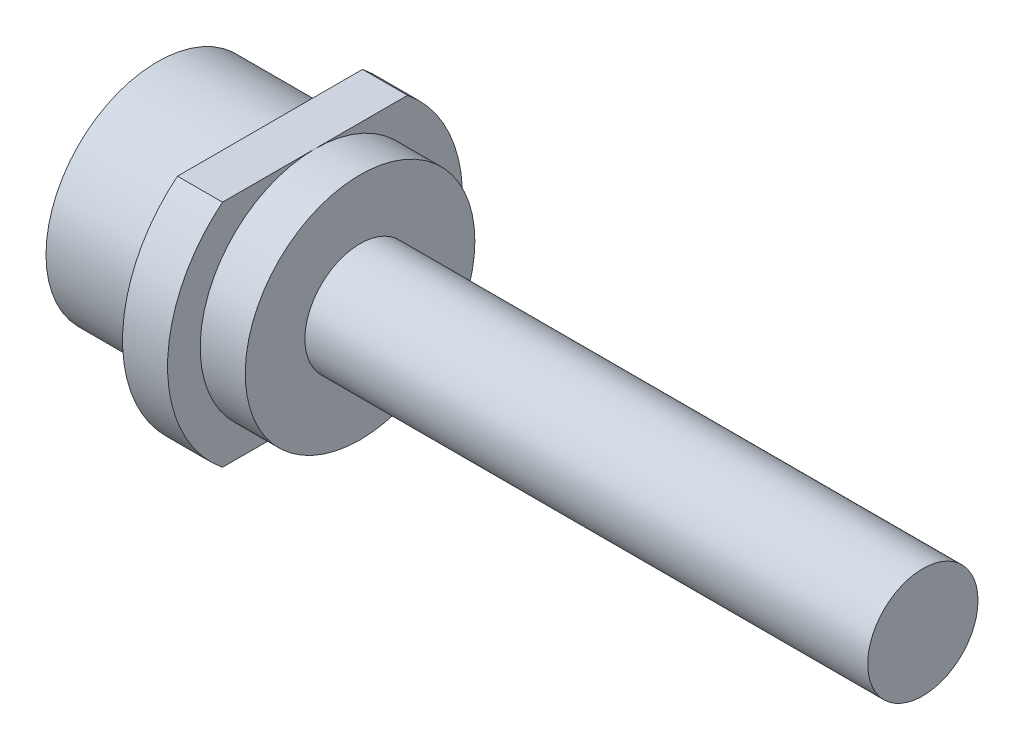
ISO-10303-21;
HEADER;
FILE_DESCRIPTION(('STEP AP214'),'2;1');
FILE_NAME('part.step','',(''),(''),'','','');
FILE_SCHEMA(('AUTOMOTIVE_DESIGN { 1 0 10303 214 1 1 1 1 }'));
ENDSEC;
DATA;
#1=APPLICATION_CONTEXT('core data for automotive mechanical design processes');
#2=APPLICATION_PROTOCOL_DEFINITION('international standard','automotive_design',2000,#1);
#3=PRODUCT_CONTEXT('',#1,'mechanical');
#4=PRODUCT('Part','Part','',(#3));
#5=PRODUCT_RELATED_PRODUCT_CATEGORY('part','',(#4));
#6=PRODUCT_DEFINITION_FORMATION('','',#4);
#7=PRODUCT_DEFINITION_CONTEXT('part definition',#1,'design');
#8=PRODUCT_DEFINITION('design','',#6,#7);
#9=PRODUCT_DEFINITION_SHAPE('','',#8);
#10=(LENGTH_UNIT() NAMED_UNIT(*) SI_UNIT(.MILLI.,.METRE.));
#11=(NAMED_UNIT(*) PLANE_ANGLE_UNIT() SI_UNIT($,.RADIAN.));
#12=(NAMED_UNIT(*) SI_UNIT($,.STERADIAN.) SOLID_ANGLE_UNIT());
#13=UNCERTAINTY_MEASURE_WITH_UNIT(LENGTH_MEASURE(1.E-05),#10,'distance_accuracy_value','');
#14=(GEOMETRIC_REPRESENTATION_CONTEXT(3) GLOBAL_UNCERTAINTY_ASSIGNED_CONTEXT((#13)) GLOBAL_UNIT_ASSIGNED_CONTEXT((#10,
#11,#12)) REPRESENTATION_CONTEXT('',''));
#15=CARTESIAN_POINT('',(0.,0.,0.));
#16=DIRECTION('',(0.,0.,1.));
#17=DIRECTION('',(1.,0.,0.));
#18=AXIS2_PLACEMENT_3D('',#15,#16,#17);
#19=CARTESIAN_POINT('',(2.,0.,0.));
#20=DIRECTION('',(1.,0.,0.));
#21=DIRECTION('',(0.,0.,-1.));
#22=AXIS2_PLACEMENT_3D('',#19,#20,#21);
#23=PLANE('',#22);
#24=CARTESIAN_POINT('',(2.,0.,0.));
#25=DIRECTION('',(1.,0.,0.));
#26=DIRECTION('',(0.,0.,-1.));
#27=AXIS2_PLACEMENT_3D('',#24,#25,#26);
#28=CIRCLE('',#27,5.1);
#29=CARTESIAN_POINT('',(2.,5.1,0.));
#30=VERTEX_POINT('',#29);
#31=CARTESIAN_POINT('',(2.,-5.1,0.));
#32=VERTEX_POINT('',#31);
#33=EDGE_CURVE('E112',#30,#32,#28,.T.);
#34=ORIENTED_EDGE('',*,*,#33,.F.);
#35=DIRECTION('',(0.,0.,1.));
#36=VECTOR('',#35,1.);
#37=CARTESIAN_POINT('',(2.,5.1,-4.11004866151242));
#38=LINE('',#37,#36);
#39=CARTESIAN_POINT('',(2.,5.1,4.11004866151242));
#40=VERTEX_POINT('',#39);
#41=EDGE_CURVE('E100',#30,#40,#38,.T.);
#42=ORIENTED_EDGE('',*,*,#41,.T.);
#43=CARTESIAN_POINT('',(2.,0.,0.));
#44=DIRECTION('',(1.,0.,0.));
#45=DIRECTION('',(0.,0.,-1.));
#46=AXIS2_PLACEMENT_3D('',#43,#44,#45);
#47=CIRCLE('',#46,6.55);
#48=CARTESIAN_POINT('',(2.,-5.1,4.11004866151242));
#49=VERTEX_POINT('',#48);
#50=EDGE_CURVE('E99',#40,#49,#47,.T.);
#51=ORIENTED_EDGE('',*,*,#50,.T.);
#52=DIRECTION('',(0.,0.,-1.));
#53=VECTOR('',#52,1.);
#54=CARTESIAN_POINT('',(2.,-5.1,-4.11004866151241));
#55=LINE('',#54,#53);
#56=EDGE_CURVE('E114',#49,#32,#55,.T.);
#57=ORIENTED_EDGE('',*,*,#56,.T.);
#58=EDGE_LOOP('',(#34,#42,#51,#57));
#59=FACE_BOUND('',#58,.T.);
#60=ADVANCED_FACE('F39',(#59),#23,.T.);
#61=CARTESIAN_POINT('',(2.,0.,0.));
#62=DIRECTION('',(-1.,0.,0.));
#63=DIRECTION('',(0.,0.,1.));
#64=AXIS2_PLACEMENT_3D('',#61,#62,#63);
#65=CYLINDRICAL_SURFACE('',#64,6.55);
#66=CARTESIAN_POINT('',(0.,0.,0.));
#67=DIRECTION('',(1.,0.,0.));
#68=DIRECTION('',(0.,0.,-1.));
#69=AXIS2_PLACEMENT_3D('',#66,#67,#68);
#70=CIRCLE('',#69,6.55);
#71=CARTESIAN_POINT('',(0.,-5.1,-4.11004866151241));
#72=VERTEX_POINT('',#71);
#73=CARTESIAN_POINT('',(0.,5.1,-4.11004866151242));
#74=VERTEX_POINT('',#73);
#75=EDGE_CURVE('E135',#72,#74,#70,.T.);
#76=ORIENTED_EDGE('',*,*,#75,.T.);
#77=DIRECTION('',(-1.,0.,0.));
#78=VECTOR('',#77,1.);
#79=CARTESIAN_POINT('',(2.,5.1,-4.11004866151242));
#80=LINE('',#79,#78);
#81=CARTESIAN_POINT('',(2.,5.1,-4.11004866151242));
#82=VERTEX_POINT('',#81);
#83=EDGE_CURVE('E43',#82,#74,#80,.T.);
#84=ORIENTED_EDGE('',*,*,#83,.F.);
#85=CARTESIAN_POINT('',(2.,0.,0.));
#86=DIRECTION('',(1.,0.,0.));
#87=DIRECTION('',(0.,0.,-1.));
#88=AXIS2_PLACEMENT_3D('',#85,#86,#87);
#89=CIRCLE('',#88,6.55);
#90=CARTESIAN_POINT('',(2.,-5.1,-4.11004866151241));
#91=VERTEX_POINT('',#90);
#92=EDGE_CURVE('E96',#91,#82,#89,.T.);
#93=ORIENTED_EDGE('',*,*,#92,.F.);
#94=DIRECTION('',(-1.,0.,0.));
#95=VECTOR('',#94,1.);
#96=CARTESIAN_POINT('',(2.,-5.1,-4.11004866151241));
#97=LINE('',#96,#95);
#98=EDGE_CURVE('E134',#91,#72,#97,.T.);
#99=ORIENTED_EDGE('',*,*,#98,.T.);
#100=EDGE_LOOP('',(#76,#84,#93,#99));
#101=FACE_BOUND('',#100,.T.);
#102=ADVANCED_FACE('F41',(#101),#65,.T.);
#103=CARTESIAN_POINT('',(2.,5.1,-4.11004866151242));
#104=DIRECTION('',(0.,-1.,0.));
#105=DIRECTION('',(0.,0.,-1.));
#106=AXIS2_PLACEMENT_3D('',#103,#104,#105);
#107=PLANE('',#106);
#108=DIRECTION('',(0.,0.,1.));
#109=VECTOR('',#108,1.);
#110=CARTESIAN_POINT('',(0.,5.1,-4.11004866151242));
#111=LINE('',#110,#109);
#112=CARTESIAN_POINT('',(0.,5.1,4.11004866151242));
#113=VERTEX_POINT('',#112);
#114=EDGE_CURVE('E139',#74,#113,#111,.T.);
#115=ORIENTED_EDGE('',*,*,#114,.T.);
#116=DIRECTION('',(-1.,0.,0.));
#117=VECTOR('',#116,1.);
#118=CARTESIAN_POINT('',(2.,5.1,4.11004866151242));
#119=LINE('',#118,#117);
#120=EDGE_CURVE('E106',#40,#113,#119,.T.);
#121=ORIENTED_EDGE('',*,*,#120,.F.);
#122=ORIENTED_EDGE('',*,*,#41,.F.);
#123=EDGE_CURVE('E91',#82,#30,#38,.T.);
#124=ORIENTED_EDGE('',*,*,#123,.F.);
#125=ORIENTED_EDGE('',*,*,#83,.T.);
#126=EDGE_LOOP('',(#115,#121,#122,#124,#125));
#127=FACE_BOUND('',#126,.T.);
#128=ADVANCED_FACE('F104',(#127),#107,.F.);
#129=CARTESIAN_POINT('',(2.,0.,0.));
#130=DIRECTION('',(-1.,0.,0.));
#131=DIRECTION('',(0.,0.,1.));
#132=AXIS2_PLACEMENT_3D('',#129,#130,#131);
#133=CYLINDRICAL_SURFACE('',#132,6.55);
#134=CARTESIAN_POINT('',(0.,0.,0.));
#135=DIRECTION('',(1.,0.,0.));
#136=DIRECTION('',(0.,0.,-1.));
#137=AXIS2_PLACEMENT_3D('',#134,#135,#136);
#138=CIRCLE('',#137,6.55);
#139=CARTESIAN_POINT('',(0.,-5.1,4.11004866151242));
#140=VERTEX_POINT('',#139);
#141=EDGE_CURVE('E142',#113,#140,#138,.T.);
#142=ORIENTED_EDGE('',*,*,#141,.T.);
#143=DIRECTION('',(-1.,0.,0.));
#144=VECTOR('',#143,1.);
#145=CARTESIAN_POINT('',(2.,-5.1,4.11004866151242));
#146=LINE('',#145,#144);
#147=EDGE_CURVE('E149',#49,#140,#146,.T.);
#148=ORIENTED_EDGE('',*,*,#147,.F.);
#149=ORIENTED_EDGE('',*,*,#50,.F.);
#150=ORIENTED_EDGE('',*,*,#120,.T.);
#151=EDGE_LOOP('',(#142,#148,#149,#150));
#152=FACE_BOUND('',#151,.T.);
#153=ADVANCED_FACE('F154',(#152),#133,.T.);
#154=CARTESIAN_POINT('',(2.,-5.1,-4.11004866151241));
#155=DIRECTION('',(0.,1.,0.));
#156=DIRECTION('',(0.,0.,1.));
#157=AXIS2_PLACEMENT_3D('',#154,#155,#156);
#158=PLANE('',#157);
#159=DIRECTION('',(0.,0.,-1.));
#160=VECTOR('',#159,1.);
#161=CARTESIAN_POINT('',(0.,-5.1,-4.11004866151241));
#162=LINE('',#161,#160);
#163=EDGE_CURVE('E84',#140,#72,#162,.T.);
#164=ORIENTED_EDGE('',*,*,#163,.T.);
#165=ORIENTED_EDGE('',*,*,#98,.F.);
#166=EDGE_CURVE('E62',#32,#91,#55,.T.);
#167=ORIENTED_EDGE('',*,*,#166,.F.);
#168=ORIENTED_EDGE('',*,*,#56,.F.);
#169=ORIENTED_EDGE('',*,*,#147,.T.);
#170=EDGE_LOOP('',(#164,#165,#167,#168,#169));
#171=FACE_BOUND('',#170,.T.);
#172=ADVANCED_FACE('F160',(#171),#158,.F.);
#173=EDGE_CURVE('E57',#32,#30,#28,.T.);
#174=ORIENTED_EDGE('',*,*,#173,.F.);
#175=ORIENTED_EDGE('',*,*,#166,.T.);
#176=ORIENTED_EDGE('',*,*,#92,.T.);
#177=ORIENTED_EDGE('',*,*,#123,.T.);
#178=EDGE_LOOP('',(#174,#175,#176,#177));
#179=FACE_BOUND('',#178,.T.);
#180=ADVANCED_FACE('F94',(#179),#23,.T.);
#181=CARTESIAN_POINT('',(0.,0.,0.));
#182=DIRECTION('',(1.,0.,0.));
#183=DIRECTION('',(0.,0.,-1.));
#184=AXIS2_PLACEMENT_3D('',#181,#182,#183);
#185=PLANE('',#184);
#186=CARTESIAN_POINT('',(0.,0.,0.));
#187=DIRECTION('',(-1.,0.,0.));
#188=DIRECTION('',(0.,0.,1.));
#189=AXIS2_PLACEMENT_3D('',#186,#187,#188);
#190=CIRCLE('',#189,4.95);
#191=CARTESIAN_POINT('',(0.,0.,4.95));
#192=VERTEX_POINT('',#191);
#193=EDGE_CURVE('E11',#192,#192,#190,.T.);
#194=ORIENTED_EDGE('',*,*,#193,.F.);
#195=EDGE_LOOP('',(#194));
#196=FACE_BOUND('',#195,.T.);
#197=ORIENTED_EDGE('',*,*,#75,.F.);
#198=ORIENTED_EDGE('',*,*,#163,.F.);
#199=ORIENTED_EDGE('',*,*,#141,.F.);
#200=ORIENTED_EDGE('',*,*,#114,.F.);
#201=EDGE_LOOP('',(#197,#198,#199,#200));
#202=FACE_BOUND('',#201,.T.);
#203=ADVANCED_FACE('F158',(#196,#202),#185,.F.);
#204=CARTESIAN_POINT('',(4.,0.,0.));
#205=DIRECTION('',(-1.,0.,0.));
#206=DIRECTION('',(0.,0.,1.));
#207=AXIS2_PLACEMENT_3D('',#204,#205,#206);
#208=CYLINDRICAL_SURFACE('',#207,5.1);
#209=CARTESIAN_POINT('',(4.,0.,0.));
#210=DIRECTION('',(1.,0.,0.));
#211=DIRECTION('',(0.,0.,-1.));
#212=AXIS2_PLACEMENT_3D('',#209,#210,#211);
#213=CIRCLE('',#212,5.1);
#214=CARTESIAN_POINT('',(4.,0.,-5.1));
#215=VERTEX_POINT('',#214);
#216=EDGE_CURVE('E117',#215,#215,#213,.T.);
#217=ORIENTED_EDGE('',*,*,#216,.F.);
#218=EDGE_LOOP('',(#217));
#219=FACE_BOUND('',#218,.T.);
#220=ORIENTED_EDGE('',*,*,#33,.T.);
#221=ORIENTED_EDGE('',*,*,#173,.T.);
#222=EDGE_LOOP('',(#220,#221));
#223=FACE_BOUND('',#222,.T.);
#224=ADVANCED_FACE('F120',(#219,#223),#208,.T.);
#225=CARTESIAN_POINT('',(4.,0.,0.));
#226=DIRECTION('',(1.,0.,0.));
#227=DIRECTION('',(0.,0.,-1.));
#228=AXIS2_PLACEMENT_3D('',#225,#226,#227);
#229=PLANE('',#228);
#230=CARTESIAN_POINT('',(4.,0.,0.));
#231=DIRECTION('',(1.,0.,0.));
#232=DIRECTION('',(0.,0.,-1.));
#233=AXIS2_PLACEMENT_3D('',#230,#231,#232);
#234=CIRCLE('',#233,2.45);
#235=CARTESIAN_POINT('',(4.,0.,-2.45));
#236=VERTEX_POINT('',#235);
#237=EDGE_CURVE('E49',#236,#236,#234,.T.);
#238=ORIENTED_EDGE('',*,*,#237,.F.);
#239=EDGE_LOOP('',(#238));
#240=FACE_BOUND('',#239,.T.);
#241=ORIENTED_EDGE('',*,*,#216,.T.);
#242=EDGE_LOOP('',(#241));
#243=FACE_BOUND('',#242,.T.);
#244=ADVANCED_FACE('F188',(#240,#243),#229,.T.);
#245=CARTESIAN_POINT('',(29.,0.,0.));
#246=DIRECTION('',(-1.,0.,0.));
#247=DIRECTION('',(0.,0.,1.));
#248=AXIS2_PLACEMENT_3D('',#245,#246,#247);
#249=CYLINDRICAL_SURFACE('',#248,2.45);
#250=CARTESIAN_POINT('',(29.,0.,0.));
#251=DIRECTION('',(1.,0.,0.));
#252=DIRECTION('',(0.,0.,-1.));
#253=AXIS2_PLACEMENT_3D('',#250,#251,#252);
#254=CIRCLE('',#253,2.45);
#255=CARTESIAN_POINT('',(29.,0.,-2.45));
#256=VERTEX_POINT('',#255);
#257=EDGE_CURVE('E118',#256,#256,#254,.T.);
#258=ORIENTED_EDGE('',*,*,#257,.F.);
#259=EDGE_LOOP('',(#258));
#260=FACE_BOUND('',#259,.T.);
#261=ORIENTED_EDGE('',*,*,#237,.T.);
#262=EDGE_LOOP('',(#261));
#263=FACE_BOUND('',#262,.T.);
#264=ADVANCED_FACE('F200',(#260,#263),#249,.T.);
#265=CARTESIAN_POINT('',(29.,0.,0.));
#266=DIRECTION('',(1.,0.,0.));
#267=DIRECTION('',(0.,0.,-1.));
#268=AXIS2_PLACEMENT_3D('',#265,#266,#267);
#269=PLANE('',#268);
#270=ORIENTED_EDGE('',*,*,#257,.T.);
#271=EDGE_LOOP('',(#270));
#272=FACE_BOUND('',#271,.T.);
#273=ADVANCED_FACE('F178',(#272),#269,.T.);
#274=CARTESIAN_POINT('',(-5.,0.,0.));
#275=DIRECTION('',(1.,0.,0.));
#276=DIRECTION('',(0.,0.,-1.));
#277=AXIS2_PLACEMENT_3D('',#274,#275,#276);
#278=CYLINDRICAL_SURFACE('',#277,4.95);
#279=CARTESIAN_POINT('',(-5.,0.,0.));
#280=DIRECTION('',(-1.,0.,0.));
#281=DIRECTION('',(0.,0.,1.));
#282=AXIS2_PLACEMENT_3D('',#279,#280,#281);
#283=CIRCLE('',#282,4.95);
#284=CARTESIAN_POINT('',(-5.,0.,4.95));
#285=VERTEX_POINT('',#284);
#286=EDGE_CURVE('E167',#285,#285,#283,.T.);
#287=ORIENTED_EDGE('',*,*,#286,.F.);
#288=EDGE_LOOP('',(#287));
#289=FACE_BOUND('',#288,.T.);
#290=ORIENTED_EDGE('',*,*,#193,.T.);
#291=EDGE_LOOP('',(#290));
#292=FACE_BOUND('',#291,.T.);
#293=ADVANCED_FACE('F175',(#289,#292),#278,.T.);
#294=CARTESIAN_POINT('',(-5.,0.,0.));
#295=DIRECTION('',(-1.,0.,0.));
#296=DIRECTION('',(0.,0.,1.));
#297=AXIS2_PLACEMENT_3D('',#294,#295,#296);
#298=PLANE('',#297);
#299=ORIENTED_EDGE('',*,*,#286,.T.);
#300=EDGE_LOOP('',(#299));
#301=FACE_BOUND('',#300,.T.);
#302=ADVANCED_FACE('F173',(#301),#298,.T.);
#303=CLOSED_SHELL('',(#60,#102,#128,#153,#172,#180,#203,#224,#244,#264,#273,#293,#302));
#304=MANIFOLD_SOLID_BREP('B2',#303);
#305=ADVANCED_BREP_SHAPE_REPRESENTATION('',(#18,#304),#14);
#306=SHAPE_DEFINITION_REPRESENTATION(#9,#305);
ENDSEC;
END-ISO-10303-21;
